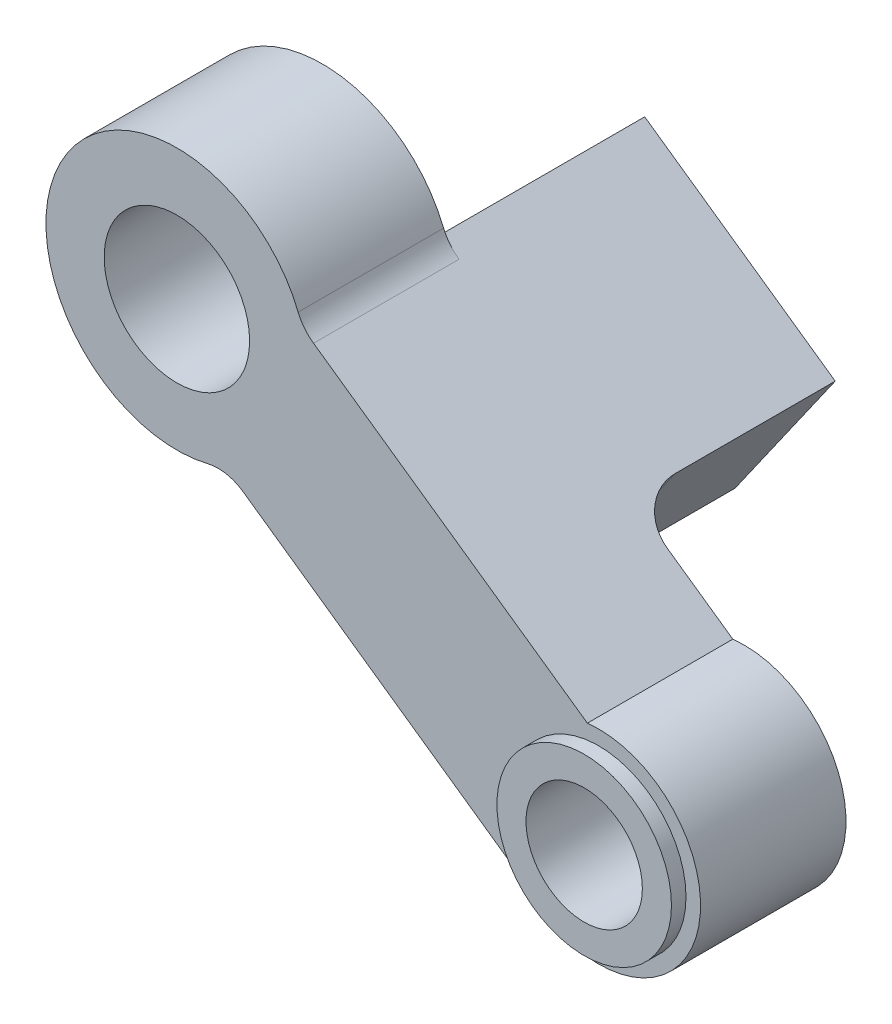
ISO-10303-21;
HEADER;
FILE_DESCRIPTION(('STEP AP214'),'2;1');
FILE_NAME('part.step','',(''),(''),'','','');
FILE_SCHEMA(('AUTOMOTIVE_DESIGN { 1 0 10303 214 1 1 1 1 }'));
ENDSEC;
DATA;
#1=APPLICATION_CONTEXT('core data for automotive mechanical design processes');
#2=APPLICATION_PROTOCOL_DEFINITION('international standard','automotive_design',2000,#1);
#3=PRODUCT_CONTEXT('',#1,'mechanical');
#4=PRODUCT('Part','Part','',(#3));
#5=PRODUCT_RELATED_PRODUCT_CATEGORY('part','',(#4));
#6=PRODUCT_DEFINITION_FORMATION('','',#4);
#7=PRODUCT_DEFINITION_CONTEXT('part definition',#1,'design');
#8=PRODUCT_DEFINITION('design','',#6,#7);
#9=PRODUCT_DEFINITION_SHAPE('','',#8);
#10=(LENGTH_UNIT() NAMED_UNIT(*) SI_UNIT(.MILLI.,.METRE.));
#11=(NAMED_UNIT(*) PLANE_ANGLE_UNIT() SI_UNIT($,.RADIAN.));
#12=(NAMED_UNIT(*) SI_UNIT($,.STERADIAN.) SOLID_ANGLE_UNIT());
#13=UNCERTAINTY_MEASURE_WITH_UNIT(LENGTH_MEASURE(1.E-05),#10,'distance_accuracy_value','');
#14=(GEOMETRIC_REPRESENTATION_CONTEXT(3) GLOBAL_UNCERTAINTY_ASSIGNED_CONTEXT((#13)) GLOBAL_UNIT_ASSIGNED_CONTEXT((#10,
#11,#12)) REPRESENTATION_CONTEXT('',''));
#15=CARTESIAN_POINT('',(0.,0.,0.));
#16=DIRECTION('',(0.,0.,1.));
#17=DIRECTION('',(1.,0.,0.));
#18=AXIS2_PLACEMENT_3D('',#15,#16,#17);
#19=CARTESIAN_POINT('',(14.5,-9.05,5.));
#20=DIRECTION('',(0.,0.,1.));
#21=DIRECTION('',(1.,0.,0.));
#22=AXIS2_PLACEMENT_3D('',#19,#20,#21);
#23=PLANE('',#22);
#24=CARTESIAN_POINT('',(0.,0.,5.));
#25=DIRECTION('',(0.,0.,1.));
#26=DIRECTION('',(1.,0.,0.));
#27=AXIS2_PLACEMENT_3D('',#24,#25,#26);
#28=CIRCLE('',#27,2.5);
#29=CARTESIAN_POINT('',(2.5,0.,5.));
#30=VERTEX_POINT('',#29);
#31=EDGE_CURVE('E173',#30,#30,#28,.T.);
#32=ORIENTED_EDGE('',*,*,#31,.F.);
#33=EDGE_LOOP('',(#32));
#34=FACE_BOUND('',#33,.T.);
#35=DIRECTION('',(-0.818662724250934,0.574274624132078,0.));
#36=VECTOR('',#35,1.);
#37=CARTESIAN_POINT('',(4.30670005617379,1.30473546213503,5.));
#38=LINE('',#37,#36);
#39=CARTESIAN_POINT('',(14.1096606419003,-5.57183450860682,5.));
#40=VERTEX_POINT('',#39);
#41=CARTESIAN_POINT('',(4.69715552562135,1.03083919042865,5.));
#42=VERTEX_POINT('',#41);
#43=EDGE_CURVE('E181',#40,#42,#38,.T.);
#44=ORIENTED_EDGE('',*,*,#43,.T.);
#45=CARTESIAN_POINT('',(5.55856746181947,2.25883327680505,5.));
#46=DIRECTION('',(0.,0.,1.));
#47=DIRECTION('',(1.,0.,0.));
#48=AXIS2_PLACEMENT_3D('',#45,#46,#47);
#49=CIRCLE('',#48,1.5);
#50=CARTESIAN_POINT('',(4.1689255963646,1.69412495760379,5.));
#51=VERTEX_POINT('',#50);
#52=EDGE_CURVE('E215',#42,#51,#49,.F.);
#53=ORIENTED_EDGE('',*,*,#52,.T.);
#54=CARTESIAN_POINT('',(0.,0.,5.));
#55=DIRECTION('',(0.,0.,1.));
#56=DIRECTION('',(-1.,0.,0.));
#57=AXIS2_PLACEMENT_3D('',#54,#55,#56);
#58=CIRCLE('',#57,4.5);
#59=CARTESIAN_POINT('',(1.06337927215083,-4.37255354724902,5.));
#60=VERTEX_POINT('',#59);
#61=EDGE_CURVE('E185',#51,#60,#58,.T.);
#62=ORIENTED_EDGE('',*,*,#61,.T.);
#63=CARTESIAN_POINT('',(1.41783902953444,-5.83007139633202,5.));
#64=DIRECTION('',(0.,0.,1.));
#65=DIRECTION('',(1.,0.,0.));
#66=AXIS2_PLACEMENT_3D('',#63,#64,#65);
#67=CIRCLE('',#66,1.5);
#68=CARTESIAN_POINT('',(2.27925096573256,-4.60207730995562,5.));
#69=VERTEX_POINT('',#68);
#70=EDGE_CURVE('E232',#60,#69,#67,.F.);
#71=ORIENTED_EDGE('',*,*,#70,.T.);
#72=DIRECTION('',(0.818662724250933,-0.574274624132079,0.));
#73=VECTOR('',#72,1.);
#74=CARTESIAN_POINT('',(1.67358332842939,-4.17721424430244,5.));
#75=LINE('',#74,#73);
#76=CARTESIAN_POINT('',(11.6574745040085,-11.180703205495,5.));
#77=VERTEX_POINT('',#76);
#78=EDGE_CURVE('E188',#69,#77,#75,.T.);
#79=ORIENTED_EDGE('',*,*,#78,.T.);
#80=CARTESIAN_POINT('',(10.7960625678104,-12.4086972918714,5.));
#81=DIRECTION('',(0.,0.,1.));
#82=DIRECTION('',(1.,0.,0.));
#83=AXIS2_PLACEMENT_3D('',#80,#81,#82);
#84=CIRCLE('',#83,1.5);
#85=CARTESIAN_POINT('',(11.9072437974673,-11.40108810431,5.));
#86=VERTEX_POINT('',#85);
#87=EDGE_CURVE('E11',#77,#86,#84,.F.);
#88=ORIENTED_EDGE('',*,*,#87,.T.);
#89=CARTESIAN_POINT('',(14.5,-9.05,5.));
#90=DIRECTION('',(0.,0.,1.));
#91=DIRECTION('',(1.,0.,0.));
#92=AXIS2_PLACEMENT_3D('',#89,#90,#91);
#93=CIRCLE('',#92,3.5);
#94=EDGE_CURVE('E179',#86,#40,#93,.T.);
#95=ORIENTED_EDGE('',*,*,#94,.T.);
#96=EDGE_LOOP('',(#44,#53,#62,#71,#79,#88,#95));
#97=FACE_BOUND('',#96,.T.);
#98=CARTESIAN_POINT('',(14.5,-9.05,5.));
#99=DIRECTION('',(0.,0.,1.));
#100=DIRECTION('',(1.,0.,0.));
#101=AXIS2_PLACEMENT_3D('',#98,#99,#100);
#102=CIRCLE('',#101,3.00000000000009);
#103=CARTESIAN_POINT('',(17.5000000000001,-9.05,5.));
#104=VERTEX_POINT('',#103);
#105=EDGE_CURVE('E153',#104,#104,#102,.T.);
#106=ORIENTED_EDGE('',*,*,#105,.F.);
#107=EDGE_LOOP('',(#106));
#108=FACE_BOUND('',#107,.T.);
#109=ADVANCED_FACE('F33',(#34,#97,#108),#23,.T.);
#110=CARTESIAN_POINT('',(14.5,-9.05,0.));
#111=DIRECTION('',(0.,0.,1.));
#112=DIRECTION('',(1.,0.,0.));
#113=AXIS2_PLACEMENT_3D('',#110,#111,#112);
#114=PLANE('',#113);
#115=CARTESIAN_POINT('',(14.5,-9.05,0.));
#116=DIRECTION('',(0.,0.,1.));
#117=DIRECTION('',(1.,0.,0.));
#118=AXIS2_PLACEMENT_3D('',#115,#116,#117);
#119=CIRCLE('',#118,2.00000000000009);
#120=CARTESIAN_POINT('',(16.5000000000001,-9.05,0.));
#121=VERTEX_POINT('',#120);
#122=EDGE_CURVE('E169',#121,#121,#119,.T.);
#123=ORIENTED_EDGE('',*,*,#122,.T.);
#124=EDGE_LOOP('',(#123));
#125=FACE_BOUND('',#124,.T.);
#126=DIRECTION('',(0.818662724250933,-0.574274624132079,0.));
#127=VECTOR('',#126,1.);
#128=CARTESIAN_POINT('',(1.67358332842939,-4.17721424430244,0.));
#129=LINE('',#128,#127);
#130=CARTESIAN_POINT('',(8.41202205939429,-8.90408680711841,0.));
#131=VERTEX_POINT('',#130);
#132=CARTESIAN_POINT('',(11.6574745040085,-11.180703205495,0.));
#133=VERTEX_POINT('',#132);
#134=EDGE_CURVE('E182',#131,#133,#129,.T.);
#135=ORIENTED_EDGE('',*,*,#134,.F.);
#136=DIRECTION('',(0.574274624132079,0.818662724250933,0.));
#137=VECTOR('',#136,1.);
#138=CARTESIAN_POINT('',(10.3511852621264,-6.13969401731833,0.));
#139=LINE('',#138,#137);
#140=CARTESIAN_POINT('',(11.8576698041868,-3.9921104616128,0.));
#141=VERTEX_POINT('',#140);
#142=EDGE_CURVE('E207',#131,#141,#139,.T.);
#143=ORIENTED_EDGE('',*,*,#142,.T.);
#144=DIRECTION('',(-0.818662724250934,0.574274624132078,0.));
#145=VECTOR('',#144,1.);
#146=CARTESIAN_POINT('',(4.30670005617379,1.30473546213503,0.));
#147=LINE('',#146,#145);
#148=CARTESIAN_POINT('',(14.1096606419003,-5.57183450860682,0.));
#149=VERTEX_POINT('',#148);
#150=EDGE_CURVE('E192',#149,#141,#147,.T.);
#151=ORIENTED_EDGE('',*,*,#150,.F.);
#152=CARTESIAN_POINT('',(14.5,-9.05,0.));
#153=DIRECTION('',(0.,0.,1.));
#154=DIRECTION('',(1.,0.,0.));
#155=AXIS2_PLACEMENT_3D('',#152,#153,#154);
#156=CIRCLE('',#155,3.5);
#157=CARTESIAN_POINT('',(11.9072437974673,-11.40108810431,0.));
#158=VERTEX_POINT('',#157);
#159=EDGE_CURVE('E176',#158,#149,#156,.T.);
#160=ORIENTED_EDGE('',*,*,#159,.F.);
#161=CARTESIAN_POINT('',(10.7960625678104,-12.4086972918714,0.));
#162=DIRECTION('',(0.,0.,1.));
#163=DIRECTION('',(1.,0.,0.));
#164=AXIS2_PLACEMENT_3D('',#161,#162,#163);
#165=CIRCLE('',#164,1.5);
#166=EDGE_CURVE('E41',#158,#133,#165,.T.);
#167=ORIENTED_EDGE('',*,*,#166,.T.);
#168=EDGE_LOOP('',(#135,#143,#151,#160,#167));
#169=FACE_BOUND('',#168,.T.);
#170=ADVANCED_FACE('F236',(#125,#169),#114,.F.);
#171=CARTESIAN_POINT('',(0.,0.,0.));
#172=DIRECTION('',(0.,0.,1.));
#173=DIRECTION('',(-1.,0.,0.));
#174=AXIS2_PLACEMENT_3D('',#171,#172,#173);
#175=CIRCLE('',#174,4.5);
#176=CARTESIAN_POINT('',(4.1689255963646,1.69412495760379,0.));
#177=VERTEX_POINT('',#176);
#178=CARTESIAN_POINT('',(1.06337927215083,-4.37255354724902,0.));
#179=VERTEX_POINT('',#178);
#180=EDGE_CURVE('E195',#177,#179,#175,.T.);
#181=ORIENTED_EDGE('',*,*,#180,.F.);
#182=CARTESIAN_POINT('',(5.55856746181947,2.25883327680505,0.));
#183=DIRECTION('',(0.,0.,1.));
#184=DIRECTION('',(1.,0.,0.));
#185=AXIS2_PLACEMENT_3D('',#182,#183,#184);
#186=CIRCLE('',#185,1.5);
#187=CARTESIAN_POINT('',(4.69715552562135,1.03083919042865,0.));
#188=VERTEX_POINT('',#187);
#189=EDGE_CURVE('E212',#177,#188,#186,.T.);
#190=ORIENTED_EDGE('',*,*,#189,.T.);
#191=DIRECTION('',(-0.818662724250934,0.574274624132078,0.));
#192=VECTOR('',#191,1.);
#193=CARTESIAN_POINT('',(16.0064845420603,-6.90241644429447,0.));
#194=LINE('',#193,#192);
#195=CARTESIAN_POINT('',(4.0803739238029,1.46349846764194,0.));
#196=VERTEX_POINT('',#195);
#197=EDGE_CURVE('E167',#188,#196,#194,.T.);
#198=ORIENTED_EDGE('',*,*,#197,.T.);
#199=DIRECTION('',(-0.574274624132079,-0.818662724250933,0.));
#200=VECTOR('',#199,1.);
#201=CARTESIAN_POINT('',(2.57388938174258,-0.684085088063578,0.));
#202=LINE('',#201,#200);
#203=CARTESIAN_POINT('',(2.04665681062733,-1.4356865603302,0.));
#204=VERTEX_POINT('',#203);
#205=EDGE_CURVE('E130',#196,#204,#202,.T.);
#206=ORIENTED_EDGE('',*,*,#205,.T.);
#207=CARTESIAN_POINT('',(0.,0.,0.));
#208=DIRECTION('',(0.,0.,1.));
#209=DIRECTION('',(1.,0.,0.));
#210=AXIS2_PLACEMENT_3D('',#207,#208,#209);
#211=CIRCLE('',#210,2.5);
#212=EDGE_CURVE('E172',#204,#204,#211,.T.);
#213=ORIENTED_EDGE('',*,*,#212,.T.);
#214=CARTESIAN_POINT('',(0.634726179010426,-3.44847787786366,0.));
#215=VERTEX_POINT('',#214);
#216=EDGE_CURVE('E133',#204,#215,#202,.T.);
#217=ORIENTED_EDGE('',*,*,#216,.T.);
#218=DIRECTION('',(0.818662724250933,-0.574274624132079,0.));
#219=VECTOR('',#218,1.);
#220=CARTESIAN_POINT('',(12.5608367972679,-11.8143927898001,0.));
#221=LINE('',#220,#219);
#222=CARTESIAN_POINT('',(2.27925096573256,-4.60207730995562,0.));
#223=VERTEX_POINT('',#222);
#224=EDGE_CURVE('E165',#215,#223,#221,.T.);
#225=ORIENTED_EDGE('',*,*,#224,.T.);
#226=CARTESIAN_POINT('',(1.41783902953444,-5.83007139633202,0.));
#227=DIRECTION('',(0.,0.,1.));
#228=DIRECTION('',(1.,0.,0.));
#229=AXIS2_PLACEMENT_3D('',#226,#227,#228);
#230=CIRCLE('',#229,1.5);
#231=EDGE_CURVE('E230',#223,#179,#230,.T.);
#232=ORIENTED_EDGE('',*,*,#231,.T.);
#233=EDGE_LOOP('',(#181,#190,#198,#206,#213,#217,#225,#232));
#234=FACE_BOUND('',#233,.T.);
#235=ADVANCED_FACE('F266',(#234),#114,.F.);
#236=CARTESIAN_POINT('',(14.5,-9.05,5.));
#237=DIRECTION('',(0.,0.,-1.));
#238=DIRECTION('',(-1.,0.,0.));
#239=AXIS2_PLACEMENT_3D('',#236,#237,#238);
#240=CYLINDRICAL_SURFACE('',#239,3.5);
#241=ORIENTED_EDGE('',*,*,#94,.F.);
#242=DIRECTION('',(0.,0.,-1.));
#243=VECTOR('',#242,1.);
#244=CARTESIAN_POINT('',(11.9072437974673,-11.40108810431,5.));
#245=LINE('',#244,#243);
#246=EDGE_CURVE('E228',#86,#158,#245,.T.);
#247=ORIENTED_EDGE('',*,*,#246,.T.);
#248=ORIENTED_EDGE('',*,*,#159,.T.);
#249=DIRECTION('',(0.,0.,-1.));
#250=VECTOR('',#249,1.);
#251=CARTESIAN_POINT('',(14.1096606419003,-5.57183450860682,5.));
#252=LINE('',#251,#250);
#253=EDGE_CURVE('E190',#40,#149,#252,.T.);
#254=ORIENTED_EDGE('',*,*,#253,.F.);
#255=EDGE_LOOP('',(#241,#247,#248,#254));
#256=FACE_BOUND('',#255,.T.);
#257=ADVANCED_FACE('F245',(#256),#240,.T.);
#258=CARTESIAN_POINT('',(4.30670005617379,1.30473546213503,5.));
#259=DIRECTION('',(-0.574274624132078,-0.818662724250934,0.));
#260=DIRECTION('',(0.818662724250934,-0.574274624132078,0.));
#261=AXIS2_PLACEMENT_3D('',#258,#259,#260);
#262=PLANE('',#261);
#263=ORIENTED_EDGE('',*,*,#197,.F.);
#264=DIRECTION('',(0.,0.,1.));
#265=VECTOR('',#264,1.);
#266=CARTESIAN_POINT('',(4.69715552562135,1.03083919042865,5.));
#267=LINE('',#266,#265);
#268=EDGE_CURVE('E205',#188,#42,#267,.T.);
#269=ORIENTED_EDGE('',*,*,#268,.T.);
#270=ORIENTED_EDGE('',*,*,#43,.F.);
#271=ORIENTED_EDGE('',*,*,#253,.T.);
#272=ORIENTED_EDGE('',*,*,#150,.T.);
#273=CARTESIAN_POINT('',(11.8576698041868,-3.9921104616128,-1.5));
#274=DIRECTION('',(-0.574274624132078,-0.818662724250934,0.));
#275=DIRECTION('',(0.818662724250934,-0.574274624132078,0.));
#276=AXIS2_PLACEMENT_3D('',#273,#274,#275);
#277=CIRCLE('',#276,1.5);
#278=CARTESIAN_POINT('',(10.6296757178104,-3.13069852541468,-1.5));
#279=VERTEX_POINT('',#278);
#280=EDGE_CURVE('E217',#141,#279,#277,.T.);
#281=ORIENTED_EDGE('',*,*,#280,.T.);
#282=DIRECTION('',(0.,0.,-1.));
#283=VECTOR('',#282,1.);
#284=CARTESIAN_POINT('',(10.6296757178104,-3.13069852541468,18.7937068196315));
#285=LINE('',#284,#283);
#286=CARTESIAN_POINT('',(10.6296757178104,-3.13069852541468,-7.));
#287=VERTEX_POINT('',#286);
#288=EDGE_CURVE('E140',#279,#287,#285,.T.);
#289=ORIENTED_EDGE('',*,*,#288,.T.);
#290=DIRECTION('',(0.818662724250934,-0.574274624132078,0.));
#291=VECTOR('',#290,1.);
#292=CARTESIAN_POINT('',(4.0803739238029,1.46349846764194,-7.));
#293=LINE('',#292,#291);
#294=CARTESIAN_POINT('',(4.0803739238029,1.46349846764194,-7.));
#295=VERTEX_POINT('',#294);
#296=EDGE_CURVE('E137',#295,#287,#293,.T.);
#297=ORIENTED_EDGE('',*,*,#296,.F.);
#298=DIRECTION('',(0.,0.,-1.));
#299=VECTOR('',#298,1.);
#300=CARTESIAN_POINT('',(4.0803739238029,1.46349846764194,18.7937068196315));
#301=LINE('',#300,#299);
#302=EDGE_CURVE('E124',#196,#295,#301,.T.);
#303=ORIENTED_EDGE('',*,*,#302,.F.);
#304=EDGE_LOOP('',(#263,#269,#270,#271,#272,#281,#289,#297,#303));
#305=FACE_BOUND('',#304,.T.);
#306=ADVANCED_FACE('F138',(#305),#262,.F.);
#307=CARTESIAN_POINT('',(0.,0.,5.));
#308=DIRECTION('',(0.,0.,-1.));
#309=DIRECTION('',(-1.,0.,0.));
#310=AXIS2_PLACEMENT_3D('',#307,#308,#309);
#311=CYLINDRICAL_SURFACE('',#310,4.5);
#312=ORIENTED_EDGE('',*,*,#180,.T.);
#313=DIRECTION('',(0.,0.,-1.));
#314=VECTOR('',#313,1.);
#315=CARTESIAN_POINT('',(1.06337927215083,-4.37255354724902,5.));
#316=LINE('',#315,#314);
#317=EDGE_CURVE('E226',#179,#60,#316,.F.);
#318=ORIENTED_EDGE('',*,*,#317,.T.);
#319=ORIENTED_EDGE('',*,*,#61,.F.);
#320=DIRECTION('',(0.,0.,-1.));
#321=VECTOR('',#320,1.);
#322=CARTESIAN_POINT('',(4.1689255963646,1.69412495760379,5.));
#323=LINE('',#322,#321);
#324=EDGE_CURVE('E202',#51,#177,#323,.T.);
#325=ORIENTED_EDGE('',*,*,#324,.T.);
#326=EDGE_LOOP('',(#312,#318,#319,#325));
#327=FACE_BOUND('',#326,.T.);
#328=ADVANCED_FACE('F257',(#327),#311,.T.);
#329=CARTESIAN_POINT('',(1.67358332842939,-4.17721424430244,5.));
#330=DIRECTION('',(0.574274624132079,0.818662724250933,0.));
#331=DIRECTION('',(-0.818662724250933,0.574274624132079,0.));
#332=AXIS2_PLACEMENT_3D('',#329,#330,#331);
#333=PLANE('',#332);
#334=ORIENTED_EDGE('',*,*,#78,.F.);
#335=DIRECTION('',(0.,0.,1.));
#336=VECTOR('',#335,1.);
#337=CARTESIAN_POINT('',(2.27925096573256,-4.60207730995562,0.));
#338=LINE('',#337,#336);
#339=EDGE_CURVE('E223',#69,#223,#338,.F.);
#340=ORIENTED_EDGE('',*,*,#339,.T.);
#341=ORIENTED_EDGE('',*,*,#224,.F.);
#342=DIRECTION('',(0.,0.,-1.));
#343=VECTOR('',#342,1.);
#344=CARTESIAN_POINT('',(0.634726179010426,-3.44847787786366,18.7937068196315));
#345=LINE('',#344,#343);
#346=CARTESIAN_POINT('',(0.634726179010426,-3.44847787786366,-7.));
#347=VERTEX_POINT('',#346);
#348=EDGE_CURVE('E134',#215,#347,#345,.T.);
#349=ORIENTED_EDGE('',*,*,#348,.T.);
#350=DIRECTION('',(-0.818662724250933,0.574274624132079,0.));
#351=VECTOR('',#350,1.);
#352=CARTESIAN_POINT('',(0.634726179010426,-3.44847787786366,-7.));
#353=LINE('',#352,#351);
#354=CARTESIAN_POINT('',(7.18402797301789,-8.04267487092029,-7.));
#355=VERTEX_POINT('',#354);
#356=EDGE_CURVE('E149',#355,#347,#353,.T.);
#357=ORIENTED_EDGE('',*,*,#356,.F.);
#358=DIRECTION('',(0.,0.,-1.));
#359=VECTOR('',#358,1.);
#360=CARTESIAN_POINT('',(7.18402797301789,-8.04267487092029,18.7937068196315));
#361=LINE('',#360,#359);
#362=CARTESIAN_POINT('',(7.18402797301789,-8.04267487092029,-1.5));
#363=VERTEX_POINT('',#362);
#364=EDGE_CURVE('E160',#363,#355,#361,.T.);
#365=ORIENTED_EDGE('',*,*,#364,.F.);
#366=CARTESIAN_POINT('',(8.41202205939429,-8.9040868071184,-1.5));
#367=DIRECTION('',(0.574274624132079,0.818662724250933,0.));
#368=DIRECTION('',(-0.818662724250933,0.574274624132079,0.));
#369=AXIS2_PLACEMENT_3D('',#366,#367,#368);
#370=CIRCLE('',#369,1.5);
#371=EDGE_CURVE('E219',#363,#131,#370,.T.);
#372=ORIENTED_EDGE('',*,*,#371,.T.);
#373=ORIENTED_EDGE('',*,*,#134,.T.);
#374=DIRECTION('',(0.,0.,1.));
#375=VECTOR('',#374,1.);
#376=CARTESIAN_POINT('',(11.6574745040085,-11.180703205495,5.));
#377=LINE('',#376,#375);
#378=EDGE_CURVE('E221',#133,#77,#377,.T.);
#379=ORIENTED_EDGE('',*,*,#378,.T.);
#380=EDGE_LOOP('',(#334,#340,#341,#349,#357,#365,#372,#373,#379));
#381=FACE_BOUND('',#380,.T.);
#382=ADVANCED_FACE('F241',(#381),#333,.F.);
#383=CARTESIAN_POINT('',(0.,0.,5.));
#384=DIRECTION('',(0.,0.,-1.));
#385=DIRECTION('',(-1.,0.,0.));
#386=AXIS2_PLACEMENT_3D('',#383,#384,#385);
#387=CYLINDRICAL_SURFACE('',#386,2.5);
#388=ORIENTED_EDGE('',*,*,#212,.F.);
#389=EDGE_LOOP('',(#388));
#390=FACE_BOUND('',#389,.T.);
#391=ORIENTED_EDGE('',*,*,#31,.T.);
#392=EDGE_LOOP('',(#391));
#393=FACE_BOUND('',#392,.T.);
#394=ADVANCED_FACE('F269',(#390,#393),#387,.F.);
#395=CARTESIAN_POINT('',(14.5,-9.05,5.));
#396=DIRECTION('',(0.,0.,-1.));
#397=DIRECTION('',(-1.,0.,0.));
#398=AXIS2_PLACEMENT_3D('',#395,#396,#397);
#399=CYLINDRICAL_SURFACE('',#398,2.00000000000009);
#400=ORIENTED_EDGE('',*,*,#122,.F.);
#401=EDGE_LOOP('',(#400));
#402=FACE_BOUND('',#401,.T.);
#403=CARTESIAN_POINT('',(14.5,-9.05,5.5));
#404=DIRECTION('',(0.,0.,1.));
#405=DIRECTION('',(1.,0.,0.));
#406=AXIS2_PLACEMENT_3D('',#403,#404,#405);
#407=CIRCLE('',#406,2.00000000000009);
#408=CARTESIAN_POINT('',(16.5000000000001,-9.05,5.5));
#409=VERTEX_POINT('',#408);
#410=EDGE_CURVE('E332',#409,#409,#407,.T.);
#411=ORIENTED_EDGE('',*,*,#410,.T.);
#412=EDGE_LOOP('',(#411));
#413=FACE_BOUND('',#412,.T.);
#414=ADVANCED_FACE('F272',(#402,#413),#399,.F.);
#415=CARTESIAN_POINT('',(7.18402797301789,-8.04267487092029,18.7937068196315));
#416=DIRECTION('',(0.818662724250933,-0.574274624132079,0.));
#417=DIRECTION('',(0.574274624132079,0.818662724250933,0.));
#418=AXIS2_PLACEMENT_3D('',#415,#416,#417);
#419=PLANE('',#418);
#420=ORIENTED_EDGE('',*,*,#288,.F.);
#421=DIRECTION('',(0.574274624132079,0.818662724250933,0.));
#422=VECTOR('',#421,1.);
#423=CARTESIAN_POINT('',(7.18402797301789,-8.04267487092029,-1.5));
#424=LINE('',#423,#422);
#425=EDGE_CURVE('E210',#279,#363,#424,.F.);
#426=ORIENTED_EDGE('',*,*,#425,.T.);
#427=ORIENTED_EDGE('',*,*,#364,.T.);
#428=DIRECTION('',(-0.574274624132079,-0.818662724250933,0.));
#429=VECTOR('',#428,1.);
#430=CARTESIAN_POINT('',(7.18402797301789,-8.04267487092029,-7.));
#431=LINE('',#430,#429);
#432=EDGE_CURVE('E144',#287,#355,#431,.T.);
#433=ORIENTED_EDGE('',*,*,#432,.F.);
#434=EDGE_LOOP('',(#420,#426,#427,#433));
#435=FACE_BOUND('',#434,.T.);
#436=ADVANCED_FACE('F321',(#435),#419,.T.);
#437=CARTESIAN_POINT('',(0.634726179010426,-3.44847787786366,18.7937068196315));
#438=DIRECTION('',(-0.818662724250933,0.574274624132079,0.));
#439=DIRECTION('',(-0.574274624132079,-0.818662724250933,0.));
#440=AXIS2_PLACEMENT_3D('',#437,#438,#439);
#441=PLANE('',#440);
#442=ORIENTED_EDGE('',*,*,#205,.F.);
#443=ORIENTED_EDGE('',*,*,#302,.T.);
#444=DIRECTION('',(0.574274624132079,0.818662724250933,0.));
#445=VECTOR('',#444,1.);
#446=CARTESIAN_POINT('',(0.634726179010426,-3.44847787786366,-7.));
#447=LINE('',#446,#445);
#448=EDGE_CURVE('E128',#347,#295,#447,.T.);
#449=ORIENTED_EDGE('',*,*,#448,.F.);
#450=ORIENTED_EDGE('',*,*,#348,.F.);
#451=ORIENTED_EDGE('',*,*,#216,.F.);
#452=EDGE_LOOP('',(#442,#443,#449,#450,#451));
#453=FACE_BOUND('',#452,.T.);
#454=ADVANCED_FACE('F126',(#453),#441,.T.);
#455=CARTESIAN_POINT('',(0.,0.,-7.));
#456=DIRECTION('',(0.,0.,-1.));
#457=DIRECTION('',(-1.,0.,0.));
#458=AXIS2_PLACEMENT_3D('',#455,#456,#457);
#459=PLANE('',#458);
#460=ORIENTED_EDGE('',*,*,#448,.T.);
#461=ORIENTED_EDGE('',*,*,#296,.T.);
#462=ORIENTED_EDGE('',*,*,#432,.T.);
#463=ORIENTED_EDGE('',*,*,#356,.T.);
#464=EDGE_LOOP('',(#460,#461,#462,#463));
#465=FACE_BOUND('',#464,.T.);
#466=ADVANCED_FACE('F147',(#465),#459,.T.);
#467=CARTESIAN_POINT('',(5.55856746181947,2.25883327680505,5.));
#468=DIRECTION('',(0.,0.,-1.));
#469=DIRECTION('',(-1.,0.,0.));
#470=AXIS2_PLACEMENT_3D('',#467,#468,#469);
#471=CYLINDRICAL_SURFACE('',#470,1.5);
#472=ORIENTED_EDGE('',*,*,#52,.F.);
#473=ORIENTED_EDGE('',*,*,#268,.F.);
#474=ORIENTED_EDGE('',*,*,#189,.F.);
#475=ORIENTED_EDGE('',*,*,#324,.F.);
#476=EDGE_LOOP('',(#472,#473,#474,#475));
#477=FACE_BOUND('',#476,.T.);
#478=ADVANCED_FACE('F252',(#477),#471,.F.);
#479=CARTESIAN_POINT('',(10.3511852621264,-6.13969401731833,-1.5));
#480=DIRECTION('',(0.574274624132079,0.818662724250933,0.));
#481=DIRECTION('',(-0.818662724250933,0.574274624132079,0.));
#482=AXIS2_PLACEMENT_3D('',#479,#480,#481);
#483=CYLINDRICAL_SURFACE('',#482,1.5);
#484=ORIENTED_EDGE('',*,*,#371,.F.);
#485=ORIENTED_EDGE('',*,*,#425,.F.);
#486=ORIENTED_EDGE('',*,*,#280,.F.);
#487=ORIENTED_EDGE('',*,*,#142,.F.);
#488=EDGE_LOOP('',(#484,#485,#486,#487));
#489=FACE_BOUND('',#488,.T.);
#490=ADVANCED_FACE('F296',(#489),#483,.F.);
#491=CARTESIAN_POINT('',(1.41783902953444,-5.83007139633202,5.));
#492=DIRECTION('',(0.,0.,-1.));
#493=DIRECTION('',(-1.,0.,0.));
#494=AXIS2_PLACEMENT_3D('',#491,#492,#493);
#495=CYLINDRICAL_SURFACE('',#494,1.5);
#496=ORIENTED_EDGE('',*,*,#70,.F.);
#497=ORIENTED_EDGE('',*,*,#317,.F.);
#498=ORIENTED_EDGE('',*,*,#231,.F.);
#499=ORIENTED_EDGE('',*,*,#339,.F.);
#500=EDGE_LOOP('',(#496,#497,#498,#499));
#501=FACE_BOUND('',#500,.T.);
#502=ADVANCED_FACE('F262',(#501),#495,.F.);
#503=CARTESIAN_POINT('',(10.7960625678104,-12.4086972918714,5.));
#504=DIRECTION('',(0.,0.,-1.));
#505=DIRECTION('',(-1.,0.,0.));
#506=AXIS2_PLACEMENT_3D('',#503,#504,#505);
#507=CYLINDRICAL_SURFACE('',#506,1.5);
#508=ORIENTED_EDGE('',*,*,#87,.F.);
#509=ORIENTED_EDGE('',*,*,#378,.F.);
#510=ORIENTED_EDGE('',*,*,#166,.F.);
#511=ORIENTED_EDGE('',*,*,#246,.F.);
#512=EDGE_LOOP('',(#508,#509,#510,#511));
#513=FACE_BOUND('',#512,.T.);
#514=ADVANCED_FACE('F35',(#513),#507,.F.);
#515=CARTESIAN_POINT('',(14.5,-9.05,5.5));
#516=DIRECTION('',(0.,0.,1.));
#517=DIRECTION('',(1.,0.,0.));
#518=AXIS2_PLACEMENT_3D('',#515,#516,#517);
#519=PLANE('',#518);
#520=CARTESIAN_POINT('',(14.5,-9.05,5.5));
#521=DIRECTION('',(0.,0.,1.));
#522=DIRECTION('',(1.,0.,0.));
#523=AXIS2_PLACEMENT_3D('',#520,#521,#522);
#524=CIRCLE('',#523,3.00000000000009);
#525=CARTESIAN_POINT('',(17.5000000000001,-9.05,5.5));
#526=VERTEX_POINT('',#525);
#527=EDGE_CURVE('E150',#526,#526,#524,.T.);
#528=ORIENTED_EDGE('',*,*,#527,.T.);
#529=EDGE_LOOP('',(#528));
#530=FACE_BOUND('',#529,.T.);
#531=ORIENTED_EDGE('',*,*,#410,.F.);
#532=EDGE_LOOP('',(#531));
#533=FACE_BOUND('',#532,.T.);
#534=ADVANCED_FACE('F303',(#530,#533),#519,.T.);
#535=CARTESIAN_POINT('',(14.5,-9.05,5.5));
#536=DIRECTION('',(0.,0.,-1.));
#537=DIRECTION('',(-1.,0.,0.));
#538=AXIS2_PLACEMENT_3D('',#535,#536,#537);
#539=CYLINDRICAL_SURFACE('',#538,3.00000000000009);
#540=ORIENTED_EDGE('',*,*,#527,.F.);
#541=EDGE_LOOP('',(#540));
#542=FACE_BOUND('',#541,.T.);
#543=ORIENTED_EDGE('',*,*,#105,.T.);
#544=EDGE_LOOP('',(#543));
#545=FACE_BOUND('',#544,.T.);
#546=ADVANCED_FACE('F307',(#542,#545),#539,.T.);
#547=CLOSED_SHELL('',(#109,#170,#235,#257,#306,#328,#382,#394,#414,#436,#454,#466,#478,#490,
#502,#514,#534,#546));
#548=MANIFOLD_SOLID_BREP('B2',#547);
#549=ADVANCED_BREP_SHAPE_REPRESENTATION('',(#18,#548),#14);
#550=SHAPE_DEFINITION_REPRESENTATION(#9,#549);
ENDSEC;
END-ISO-10303-21;
